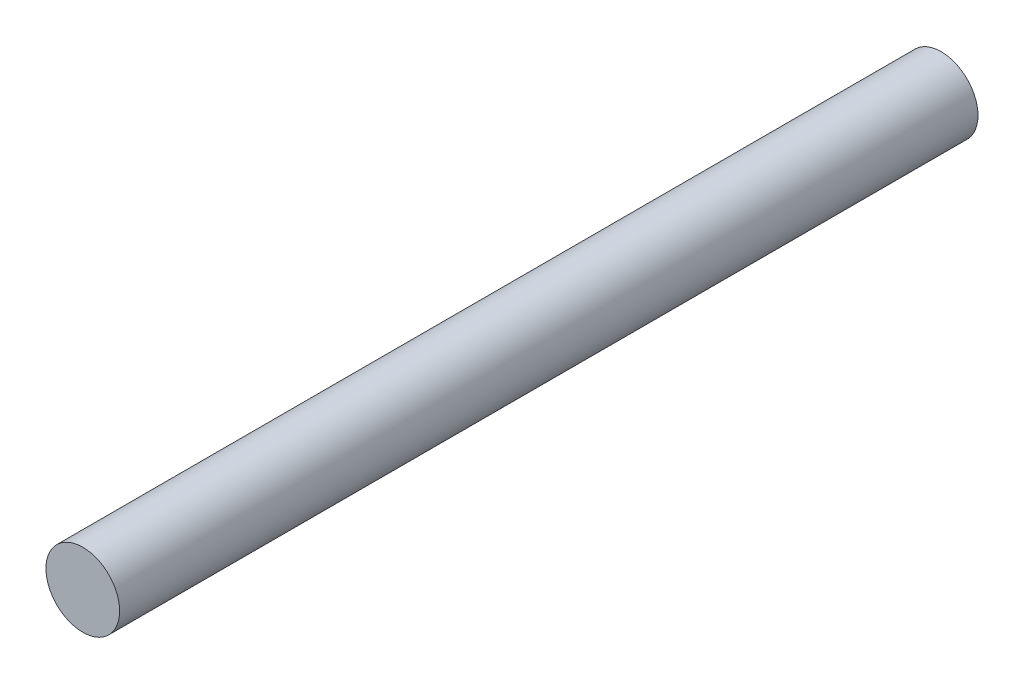
ISO-10303-21;
HEADER;
FILE_DESCRIPTION(('STEP AP214'),'2;1');
FILE_NAME('part.step','',(''),(''),'','','');
FILE_SCHEMA(('AUTOMOTIVE_DESIGN { 1 0 10303 214 1 1 1 1 }'));
ENDSEC;
DATA;
#1=APPLICATION_CONTEXT('core data for automotive mechanical design processes');
#2=APPLICATION_PROTOCOL_DEFINITION('international standard','automotive_design',2000,#1);
#3=PRODUCT_CONTEXT('',#1,'mechanical');
#4=PRODUCT('Part','Part','',(#3));
#5=PRODUCT_RELATED_PRODUCT_CATEGORY('part','',(#4));
#6=PRODUCT_DEFINITION_FORMATION('','',#4);
#7=PRODUCT_DEFINITION_CONTEXT('part definition',#1,'design');
#8=PRODUCT_DEFINITION('design','',#6,#7);
#9=PRODUCT_DEFINITION_SHAPE('','',#8);
#10=(LENGTH_UNIT() NAMED_UNIT(*) SI_UNIT(.MILLI.,.METRE.));
#11=(NAMED_UNIT(*) PLANE_ANGLE_UNIT() SI_UNIT($,.RADIAN.));
#12=(NAMED_UNIT(*) SI_UNIT($,.STERADIAN.) SOLID_ANGLE_UNIT());
#13=UNCERTAINTY_MEASURE_WITH_UNIT(LENGTH_MEASURE(1.E-05),#10,'distance_accuracy_value','');
#14=(GEOMETRIC_REPRESENTATION_CONTEXT(3) GLOBAL_UNCERTAINTY_ASSIGNED_CONTEXT((#13)) GLOBAL_UNIT_ASSIGNED_CONTEXT((#10,
#11,#12)) REPRESENTATION_CONTEXT('',''));
#15=CARTESIAN_POINT('',(0.,0.,0.));
#16=DIRECTION('',(0.,0.,1.));
#17=DIRECTION('',(1.,0.,0.));
#18=AXIS2_PLACEMENT_3D('',#15,#16,#17);
#19=CARTESIAN_POINT('',(115.613664310717,46.3379588594764,-113.939013331705));
#20=DIRECTION('',(0.,0.,1.));
#21=DIRECTION('',(1.,0.,0.));
#22=AXIS2_PLACEMENT_3D('',#19,#20,#21);
#23=CYLINDRICAL_SURFACE('',#22,4.36249999999999);
#24=CARTESIAN_POINT('',(115.613664310717,46.3379588594764,-101.6));
#25=DIRECTION('',(0.,0.,1.));
#26=DIRECTION('',(1.,0.,0.));
#27=AXIS2_PLACEMENT_3D('',#24,#25,#26);
#28=CIRCLE('',#27,4.36249999999999);
#29=CARTESIAN_POINT('',(119.976164310717,46.3379588594764,-101.6));
#30=VERTEX_POINT('',#29);
#31=EDGE_CURVE('E12',#30,#30,#28,.F.);
#32=ORIENTED_EDGE('',*,*,#31,.F.);
#33=EDGE_LOOP('',(#32));
#34=FACE_BOUND('',#33,.T.);
#35=CARTESIAN_POINT('',(115.613664310717,46.3379588594764,0.));
#36=DIRECTION('',(0.,0.,1.));
#37=DIRECTION('',(1.,0.,0.));
#38=AXIS2_PLACEMENT_3D('',#35,#36,#37);
#39=CIRCLE('',#38,4.36249999999999);
#40=CARTESIAN_POINT('',(119.976164310717,46.3379588594764,0.));
#41=VERTEX_POINT('',#40);
#42=EDGE_CURVE('E47',#41,#41,#39,.T.);
#43=ORIENTED_EDGE('',*,*,#42,.F.);
#44=EDGE_LOOP('',(#43));
#45=FACE_BOUND('',#44,.T.);
#46=ADVANCED_FACE('F41',(#34,#45),#23,.T.);
#47=CARTESIAN_POINT('',(115.613664310717,46.3379588594764,0.));
#48=DIRECTION('',(0.,0.,1.));
#49=DIRECTION('',(1.,0.,0.));
#50=AXIS2_PLACEMENT_3D('',#47,#48,#49);
#51=PLANE('',#50);
#52=ORIENTED_EDGE('',*,*,#42,.T.);
#53=EDGE_LOOP('',(#52));
#54=FACE_BOUND('',#53,.T.);
#55=ADVANCED_FACE('F53',(#54),#51,.T.);
#56=CARTESIAN_POINT('',(101.426299693665,18.004625526143,-101.6));
#57=DIRECTION('',(0.,0.,1.));
#58=DIRECTION('',(1.,0.,0.));
#59=AXIS2_PLACEMENT_3D('',#56,#57,#58);
#60=PLANE('',#59);
#61=ORIENTED_EDGE('',*,*,#31,.T.);
#62=EDGE_LOOP('',(#61));
#63=FACE_BOUND('',#62,.T.);
#64=ADVANCED_FACE('F60',(#63),#60,.F.);
#65=CLOSED_SHELL('',(#46,#55,#64));
#66=MANIFOLD_SOLID_BREP('B2',#65);
#67=ADVANCED_BREP_SHAPE_REPRESENTATION('',(#18,#66),#14);
#68=SHAPE_DEFINITION_REPRESENTATION(#9,#67);
ENDSEC;
END-ISO-10303-21;
